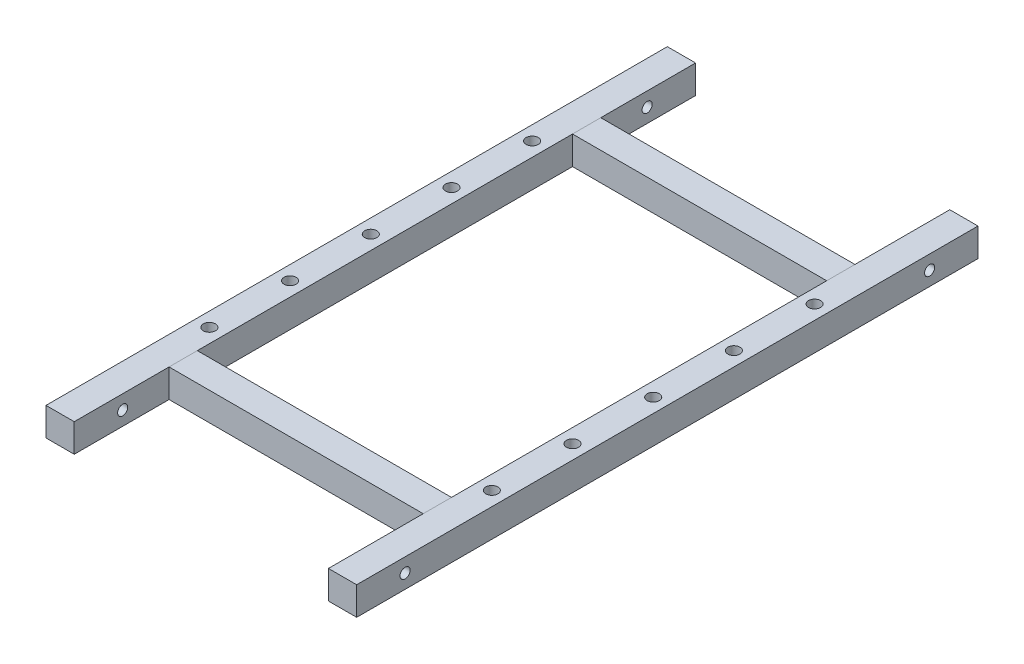
ISO-10303-21;
HEADER;
FILE_DESCRIPTION(('STEP AP214'),'2;1');
FILE_NAME('part.step','',(''),(''),'','','');
FILE_SCHEMA(('AUTOMOTIVE_DESIGN { 1 0 10303 214 1 1 1 1 }'));
ENDSEC;
DATA;
#1=APPLICATION_CONTEXT('core data for automotive mechanical design processes');
#2=APPLICATION_PROTOCOL_DEFINITION('international standard','automotive_design',2000,#1);
#3=PRODUCT_CONTEXT('',#1,'mechanical');
#4=PRODUCT('Part','Part','',(#3));
#5=PRODUCT_RELATED_PRODUCT_CATEGORY('part','',(#4));
#6=PRODUCT_DEFINITION_FORMATION('','',#4);
#7=PRODUCT_DEFINITION_CONTEXT('part definition',#1,'design');
#8=PRODUCT_DEFINITION('design','',#6,#7);
#9=PRODUCT_DEFINITION_SHAPE('','',#8);
#10=(LENGTH_UNIT() NAMED_UNIT(*) SI_UNIT(.MILLI.,.METRE.));
#11=(NAMED_UNIT(*) PLANE_ANGLE_UNIT() SI_UNIT($,.RADIAN.));
#12=(NAMED_UNIT(*) SI_UNIT($,.STERADIAN.) SOLID_ANGLE_UNIT());
#13=UNCERTAINTY_MEASURE_WITH_UNIT(LENGTH_MEASURE(1.E-05),#10,'distance_accuracy_value','');
#14=(GEOMETRIC_REPRESENTATION_CONTEXT(3) GLOBAL_UNCERTAINTY_ASSIGNED_CONTEXT((#13)) GLOBAL_UNIT_ASSIGNED_CONTEXT((#10,
#11,#12)) REPRESENTATION_CONTEXT('',''));
#15=CARTESIAN_POINT('',(0.,0.,0.));
#16=DIRECTION('',(0.,0.,1.));
#17=DIRECTION('',(1.,0.,0.));
#18=AXIS2_PLACEMENT_3D('',#15,#16,#17);
#19=CARTESIAN_POINT('',(35.,3.5,-46.5));
#20=DIRECTION('',(0.,-1.,0.));
#21=DIRECTION('',(0.,0.,-1.));
#22=AXIS2_PLACEMENT_3D('',#19,#20,#21);
#23=PLANE('',#22);
#24=DIRECTION('',(0.,0.,-1.));
#25=VECTOR('',#24,1.);
#26=CARTESIAN_POINT('',(31.5,3.5,77.));
#27=LINE('',#26,#25);
#28=CARTESIAN_POINT('',(31.5,3.5,-46.5));
#29=VERTEX_POINT('',#28);
#30=CARTESIAN_POINT('',(31.5,3.5,-53.5));
#31=VERTEX_POINT('',#30);
#32=EDGE_CURVE('E95',#29,#31,#27,.T.);
#33=ORIENTED_EDGE('',*,*,#32,.T.);
#34=DIRECTION('',(-1.,0.,0.));
#35=VECTOR('',#34,1.);
#36=CARTESIAN_POINT('',(35.,3.5,-53.5));
#37=LINE('',#36,#35);
#38=CARTESIAN_POINT('',(-31.5,3.5,-53.5));
#39=VERTEX_POINT('',#38);
#40=EDGE_CURVE('E102',#31,#39,#37,.T.);
#41=ORIENTED_EDGE('',*,*,#40,.T.);
#42=DIRECTION('',(0.,0.,-1.));
#43=VECTOR('',#42,1.);
#44=CARTESIAN_POINT('',(-31.5,3.5,-46.5));
#45=LINE('',#44,#43);
#46=CARTESIAN_POINT('',(-31.5,3.5,-46.5));
#47=VERTEX_POINT('',#46);
#48=EDGE_CURVE('E113',#47,#39,#45,.T.);
#49=ORIENTED_EDGE('',*,*,#48,.F.);
#50=DIRECTION('',(-1.,0.,0.));
#51=VECTOR('',#50,1.);
#52=CARTESIAN_POINT('',(35.,3.5,-46.5));
#53=LINE('',#52,#51);
#54=EDGE_CURVE('E64',#29,#47,#53,.T.);
#55=ORIENTED_EDGE('',*,*,#54,.F.);
#56=EDGE_LOOP('',(#33,#41,#49,#55));
#57=FACE_BOUND('',#56,.T.);
#58=ADVANCED_FACE('F61',(#57),#23,.F.);
#59=CARTESIAN_POINT('',(35.,3.5,-53.5));
#60=DIRECTION('',(0.,0.,1.));
#61=DIRECTION('',(1.,0.,0.));
#62=AXIS2_PLACEMENT_3D('',#59,#60,#61);
#63=PLANE('',#62);
#64=DIRECTION('',(0.,1.,0.));
#65=VECTOR('',#64,1.);
#66=CARTESIAN_POINT('',(31.5,3.5,-53.5));
#67=LINE('',#66,#65);
#68=CARTESIAN_POINT('',(31.5,-3.5,-53.5));
#69=VERTEX_POINT('',#68);
#70=EDGE_CURVE('E98',#69,#31,#67,.T.);
#71=ORIENTED_EDGE('',*,*,#70,.F.);
#72=DIRECTION('',(-1.,0.,0.));
#73=VECTOR('',#72,1.);
#74=CARTESIAN_POINT('',(35.,-3.5,-53.5));
#75=LINE('',#74,#73);
#76=CARTESIAN_POINT('',(-31.5,-3.5,-53.5));
#77=VERTEX_POINT('',#76);
#78=EDGE_CURVE('E122',#69,#77,#75,.T.);
#79=ORIENTED_EDGE('',*,*,#78,.T.);
#80=DIRECTION('',(0.,-1.,0.));
#81=VECTOR('',#80,1.);
#82=CARTESIAN_POINT('',(-31.5,3.5,-53.5));
#83=LINE('',#82,#81);
#84=EDGE_CURVE('E126',#39,#77,#83,.T.);
#85=ORIENTED_EDGE('',*,*,#84,.F.);
#86=ORIENTED_EDGE('',*,*,#40,.F.);
#87=EDGE_LOOP('',(#71,#79,#85,#86));
#88=FACE_BOUND('',#87,.T.);
#89=ADVANCED_FACE('F134',(#88),#63,.F.);
#90=CARTESIAN_POINT('',(35.,-3.5,-46.5));
#91=DIRECTION('',(0.,1.,0.));
#92=DIRECTION('',(0.,0.,1.));
#93=AXIS2_PLACEMENT_3D('',#90,#91,#92);
#94=PLANE('',#93);
#95=DIRECTION('',(0.,0.,-1.));
#96=VECTOR('',#95,1.);
#97=CARTESIAN_POINT('',(31.5,-3.5,77.));
#98=LINE('',#97,#96);
#99=CARTESIAN_POINT('',(31.5,-3.5,-46.5));
#100=VERTEX_POINT('',#99);
#101=EDGE_CURVE('E13',#100,#69,#98,.T.);
#102=ORIENTED_EDGE('',*,*,#101,.F.);
#103=DIRECTION('',(-1.,0.,0.));
#104=VECTOR('',#103,1.);
#105=CARTESIAN_POINT('',(35.,-3.5,-46.5));
#106=LINE('',#105,#104);
#107=CARTESIAN_POINT('',(-31.5,-3.5,-46.5));
#108=VERTEX_POINT('',#107);
#109=EDGE_CURVE('E109',#100,#108,#106,.T.);
#110=ORIENTED_EDGE('',*,*,#109,.T.);
#111=DIRECTION('',(0.,0.,-1.));
#112=VECTOR('',#111,1.);
#113=CARTESIAN_POINT('',(-31.5,-3.5,77.));
#114=LINE('',#113,#112);
#115=EDGE_CURVE('E115',#108,#77,#114,.T.);
#116=ORIENTED_EDGE('',*,*,#115,.T.);
#117=ORIENTED_EDGE('',*,*,#78,.F.);
#118=EDGE_LOOP('',(#102,#110,#116,#117));
#119=FACE_BOUND('',#118,.T.);
#120=ADVANCED_FACE('F135',(#119),#94,.F.);
#121=CARTESIAN_POINT('',(35.,3.5,-46.5));
#122=DIRECTION('',(0.,0.,-1.));
#123=DIRECTION('',(-1.,0.,0.));
#124=AXIS2_PLACEMENT_3D('',#121,#122,#123);
#125=PLANE('',#124);
#126=DIRECTION('',(0.,-1.,0.));
#127=VECTOR('',#126,1.);
#128=CARTESIAN_POINT('',(31.5,3.5,-46.5));
#129=LINE('',#128,#127);
#130=EDGE_CURVE('E70',#29,#100,#129,.T.);
#131=ORIENTED_EDGE('',*,*,#130,.F.);
#132=ORIENTED_EDGE('',*,*,#54,.T.);
#133=DIRECTION('',(0.,1.,0.));
#134=VECTOR('',#133,1.);
#135=CARTESIAN_POINT('',(-31.5,3.5,-46.5));
#136=LINE('',#135,#134);
#137=EDGE_CURVE('E114',#108,#47,#136,.T.);
#138=ORIENTED_EDGE('',*,*,#137,.F.);
#139=ORIENTED_EDGE('',*,*,#109,.F.);
#140=EDGE_LOOP('',(#131,#132,#138,#139));
#141=FACE_BOUND('',#140,.T.);
#142=ADVANCED_FACE('F106',(#141),#125,.F.);
#143=CARTESIAN_POINT('',(-31.5,3.5,77.));
#144=DIRECTION('',(-1.,0.,0.));
#145=DIRECTION('',(0.,0.,1.));
#146=AXIS2_PLACEMENT_3D('',#143,#144,#145);
#147=PLANE('',#146);
#148=ORIENTED_EDGE('',*,*,#137,.T.);
#149=ORIENTED_EDGE('',*,*,#48,.T.);
#150=ORIENTED_EDGE('',*,*,#84,.T.);
#151=ORIENTED_EDGE('',*,*,#115,.F.);
#152=EDGE_LOOP('',(#148,#149,#150,#151));
#153=FACE_BOUND('',#152,.T.);
#154=ADVANCED_FACE('F132',(#153),#147,.T.);
#155=CARTESIAN_POINT('',(31.5,3.5,77.));
#156=DIRECTION('',(1.,0.,0.));
#157=DIRECTION('',(0.,0.,-1.));
#158=AXIS2_PLACEMENT_3D('',#155,#156,#157);
#159=PLANE('',#158);
#160=ORIENTED_EDGE('',*,*,#70,.T.);
#161=ORIENTED_EDGE('',*,*,#32,.F.);
#162=ORIENTED_EDGE('',*,*,#130,.T.);
#163=ORIENTED_EDGE('',*,*,#101,.T.);
#164=EDGE_LOOP('',(#160,#161,#162,#163));
#165=FACE_BOUND('',#164,.T.);
#166=ADVANCED_FACE('F97',(#165),#159,.T.);
#167=CLOSED_SHELL('',(#58,#89,#120,#142,#154,#166));
#168=MANIFOLD_SOLID_BREP('B2',#167);
#169=CARTESIAN_POINT('',(31.5,3.5,77.));
#170=DIRECTION('',(1.,0.,0.));
#171=DIRECTION('',(0.,0.,-1.));
#172=AXIS2_PLACEMENT_3D('',#169,#170,#171);
#173=PLANE('',#172);
#174=DIRECTION('',(0.,-1.,0.));
#175=VECTOR('',#174,1.);
#176=CARTESIAN_POINT('',(31.5,3.5,53.5));
#177=LINE('',#176,#175);
#178=CARTESIAN_POINT('',(31.5,3.5,53.5));
#179=VERTEX_POINT('',#178);
#180=CARTESIAN_POINT('',(31.5,-3.5,53.5));
#181=VERTEX_POINT('',#180);
#182=EDGE_CURVE('E254',#179,#181,#177,.T.);
#183=ORIENTED_EDGE('',*,*,#182,.T.);
#184=DIRECTION('',(0.,0.,-1.));
#185=VECTOR('',#184,1.);
#186=CARTESIAN_POINT('',(31.5,-3.5,77.));
#187=LINE('',#186,#185);
#188=CARTESIAN_POINT('',(31.5,-3.5,46.5));
#189=VERTEX_POINT('',#188);
#190=EDGE_CURVE('E281',#181,#189,#187,.T.);
#191=ORIENTED_EDGE('',*,*,#190,.T.);
#192=DIRECTION('',(0.,1.,0.));
#193=VECTOR('',#192,1.);
#194=CARTESIAN_POINT('',(31.5,3.5,46.5));
#195=LINE('',#194,#193);
#196=CARTESIAN_POINT('',(31.5,3.5,46.5));
#197=VERTEX_POINT('',#196);
#198=EDGE_CURVE('E292',#189,#197,#195,.T.);
#199=ORIENTED_EDGE('',*,*,#198,.T.);
#200=DIRECTION('',(0.,0.,1.));
#201=VECTOR('',#200,1.);
#202=CARTESIAN_POINT('',(31.5,3.5,53.5));
#203=LINE('',#202,#201);
#204=EDGE_CURVE('E231',#197,#179,#203,.T.);
#205=ORIENTED_EDGE('',*,*,#204,.T.);
#206=EDGE_LOOP('',(#183,#191,#199,#205));
#207=FACE_BOUND('',#206,.T.);
#208=ADVANCED_FACE('F223',(#207),#173,.T.);
#209=CARTESIAN_POINT('',(35.,3.5,53.5));
#210=DIRECTION('',(0.,-1.,0.));
#211=DIRECTION('',(0.,0.,-1.));
#212=AXIS2_PLACEMENT_3D('',#209,#210,#211);
#213=PLANE('',#212);
#214=DIRECTION('',(0.,0.,-1.));
#215=VECTOR('',#214,1.);
#216=CARTESIAN_POINT('',(-31.5,3.5,53.5));
#217=LINE('',#216,#215);
#218=CARTESIAN_POINT('',(-31.5,3.5,53.5));
#219=VERTEX_POINT('',#218);
#220=CARTESIAN_POINT('',(-31.5,3.5,46.5));
#221=VERTEX_POINT('',#220);
#222=EDGE_CURVE('E59',#219,#221,#217,.T.);
#223=ORIENTED_EDGE('',*,*,#222,.F.);
#224=DIRECTION('',(-1.,0.,0.));
#225=VECTOR('',#224,1.);
#226=CARTESIAN_POINT('',(35.,3.5,53.5));
#227=LINE('',#226,#225);
#228=EDGE_CURVE('E286',#179,#219,#227,.T.);
#229=ORIENTED_EDGE('',*,*,#228,.F.);
#230=ORIENTED_EDGE('',*,*,#204,.F.);
#231=DIRECTION('',(-1.,0.,0.));
#232=VECTOR('',#231,1.);
#233=CARTESIAN_POINT('',(35.,3.5,46.5));
#234=LINE('',#233,#232);
#235=EDGE_CURVE('E274',#197,#221,#234,.T.);
#236=ORIENTED_EDGE('',*,*,#235,.T.);
#237=EDGE_LOOP('',(#223,#229,#230,#236));
#238=FACE_BOUND('',#237,.T.);
#239=ADVANCED_FACE('F279',(#238),#213,.F.);
#240=CARTESIAN_POINT('',(35.,3.5,46.5));
#241=DIRECTION('',(0.,0.,1.));
#242=DIRECTION('',(1.,0.,0.));
#243=AXIS2_PLACEMENT_3D('',#240,#241,#242);
#244=PLANE('',#243);
#245=DIRECTION('',(0.,-1.,0.));
#246=VECTOR('',#245,1.);
#247=CARTESIAN_POINT('',(-31.5,3.5,46.5));
#248=LINE('',#247,#246);
#249=CARTESIAN_POINT('',(-31.5,-3.5,46.5));
#250=VERTEX_POINT('',#249);
#251=EDGE_CURVE('E259',#221,#250,#248,.T.);
#252=ORIENTED_EDGE('',*,*,#251,.F.);
#253=ORIENTED_EDGE('',*,*,#235,.F.);
#254=ORIENTED_EDGE('',*,*,#198,.F.);
#255=DIRECTION('',(-1.,0.,0.));
#256=VECTOR('',#255,1.);
#257=CARTESIAN_POINT('',(35.,-3.5,46.5));
#258=LINE('',#257,#256);
#259=EDGE_CURVE('E276',#189,#250,#258,.T.);
#260=ORIENTED_EDGE('',*,*,#259,.T.);
#261=EDGE_LOOP('',(#252,#253,#254,#260));
#262=FACE_BOUND('',#261,.T.);
#263=ADVANCED_FACE('F272',(#262),#244,.F.);
#264=CARTESIAN_POINT('',(35.,-3.5,53.5));
#265=DIRECTION('',(0.,1.,0.));
#266=DIRECTION('',(0.,0.,1.));
#267=AXIS2_PLACEMENT_3D('',#264,#265,#266);
#268=PLANE('',#267);
#269=DIRECTION('',(0.,0.,-1.));
#270=VECTOR('',#269,1.);
#271=CARTESIAN_POINT('',(-31.5,-3.5,77.));
#272=LINE('',#271,#270);
#273=CARTESIAN_POINT('',(-31.5,-3.5,53.5));
#274=VERTEX_POINT('',#273);
#275=EDGE_CURVE('E277',#274,#250,#272,.T.);
#276=ORIENTED_EDGE('',*,*,#275,.T.);
#277=ORIENTED_EDGE('',*,*,#259,.F.);
#278=ORIENTED_EDGE('',*,*,#190,.F.);
#279=DIRECTION('',(-1.,0.,0.));
#280=VECTOR('',#279,1.);
#281=CARTESIAN_POINT('',(35.,-3.5,53.5));
#282=LINE('',#281,#280);
#283=EDGE_CURVE('E283',#181,#274,#282,.T.);
#284=ORIENTED_EDGE('',*,*,#283,.T.);
#285=EDGE_LOOP('',(#276,#277,#278,#284));
#286=FACE_BOUND('',#285,.T.);
#287=ADVANCED_FACE('F297',(#286),#268,.F.);
#288=CARTESIAN_POINT('',(35.,3.5,53.5));
#289=DIRECTION('',(0.,0.,-1.));
#290=DIRECTION('',(-1.,0.,0.));
#291=AXIS2_PLACEMENT_3D('',#288,#289,#290);
#292=PLANE('',#291);
#293=DIRECTION('',(0.,1.,0.));
#294=VECTOR('',#293,1.);
#295=CARTESIAN_POINT('',(-31.5,3.5,53.5));
#296=LINE('',#295,#294);
#297=EDGE_CURVE('E237',#274,#219,#296,.T.);
#298=ORIENTED_EDGE('',*,*,#297,.F.);
#299=ORIENTED_EDGE('',*,*,#283,.F.);
#300=ORIENTED_EDGE('',*,*,#182,.F.);
#301=ORIENTED_EDGE('',*,*,#228,.T.);
#302=EDGE_LOOP('',(#298,#299,#300,#301));
#303=FACE_BOUND('',#302,.T.);
#304=ADVANCED_FACE('F225',(#303),#292,.F.);
#305=CARTESIAN_POINT('',(-31.5,3.5,77.));
#306=DIRECTION('',(-1.,0.,0.));
#307=DIRECTION('',(0.,0.,1.));
#308=AXIS2_PLACEMENT_3D('',#305,#306,#307);
#309=PLANE('',#308);
#310=ORIENTED_EDGE('',*,*,#297,.T.);
#311=ORIENTED_EDGE('',*,*,#222,.T.);
#312=ORIENTED_EDGE('',*,*,#251,.T.);
#313=ORIENTED_EDGE('',*,*,#275,.F.);
#314=EDGE_LOOP('',(#310,#311,#312,#313));
#315=FACE_BOUND('',#314,.T.);
#316=ADVANCED_FACE('F264',(#315),#309,.T.);
#317=CLOSED_SHELL('',(#208,#239,#263,#287,#304,#316));
#318=MANIFOLD_SOLID_BREP('B7',#317);
#319=CARTESIAN_POINT('',(31.5,3.5,77.));
#320=DIRECTION('',(1.,0.,0.));
#321=DIRECTION('',(0.,0.,-1.));
#322=AXIS2_PLACEMENT_3D('',#319,#320,#321);
#323=PLANE('',#322);
#324=CARTESIAN_POINT('',(31.5,0.,65.));
#325=DIRECTION('',(-1.,0.,0.));
#326=DIRECTION('',(0.,0.,1.));
#327=AXIS2_PLACEMENT_3D('',#324,#325,#326);
#328=CIRCLE('',#327,1.25);
#329=CARTESIAN_POINT('',(31.5,0.,66.25));
#330=VERTEX_POINT('',#329);
#331=EDGE_CURVE('E466',#330,#330,#328,.F.);
#332=ORIENTED_EDGE('',*,*,#331,.T.);
#333=EDGE_LOOP('',(#332));
#334=FACE_BOUND('',#333,.T.);
#335=CARTESIAN_POINT('',(31.5,0.,-65.));
#336=DIRECTION('',(1.,0.,0.));
#337=DIRECTION('',(0.,0.,-1.));
#338=AXIS2_PLACEMENT_3D('',#335,#336,#337);
#339=CIRCLE('',#338,1.25);
#340=CARTESIAN_POINT('',(31.5,0.,-66.25));
#341=VERTEX_POINT('',#340);
#342=EDGE_CURVE('E450',#341,#341,#339,.F.);
#343=ORIENTED_EDGE('',*,*,#342,.F.);
#344=EDGE_LOOP('',(#343));
#345=FACE_BOUND('',#344,.T.);
#346=DIRECTION('',(0.,-1.,0.));
#347=VECTOR('',#346,1.);
#348=CARTESIAN_POINT('',(31.5,3.5,-77.));
#349=LINE('',#348,#347);
#350=CARTESIAN_POINT('',(31.5,3.5,-77.));
#351=VERTEX_POINT('',#350);
#352=CARTESIAN_POINT('',(31.5,-3.5,-77.));
#353=VERTEX_POINT('',#352);
#354=EDGE_CURVE('E447',#351,#353,#349,.T.);
#355=ORIENTED_EDGE('',*,*,#354,.T.);
#356=DIRECTION('',(0.,0.,-1.));
#357=VECTOR('',#356,1.);
#358=CARTESIAN_POINT('',(31.5,-3.5,77.));
#359=LINE('',#358,#357);
#360=CARTESIAN_POINT('',(31.5,-3.5,77.));
#361=VERTEX_POINT('',#360);
#362=EDGE_CURVE('E221',#361,#353,#359,.T.);
#363=ORIENTED_EDGE('',*,*,#362,.F.);
#364=DIRECTION('',(0.,-1.,0.));
#365=VECTOR('',#364,1.);
#366=CARTESIAN_POINT('',(31.5,3.5,77.));
#367=LINE('',#366,#365);
#368=CARTESIAN_POINT('',(31.5,3.5,77.));
#369=VERTEX_POINT('',#368);
#370=EDGE_CURVE('E435',#369,#361,#367,.T.);
#371=ORIENTED_EDGE('',*,*,#370,.F.);
#372=DIRECTION('',(0.,0.,-1.));
#373=VECTOR('',#372,1.);
#374=CARTESIAN_POINT('',(31.5,3.5,77.));
#375=LINE('',#374,#373);
#376=EDGE_CURVE('E443',#369,#351,#375,.T.);
#377=ORIENTED_EDGE('',*,*,#376,.T.);
#378=EDGE_LOOP('',(#355,#363,#371,#377));
#379=FACE_BOUND('',#378,.T.);
#380=ADVANCED_FACE('F384',(#334,#345,#379),#323,.F.);
#381=CARTESIAN_POINT('',(31.5,-3.5,77.));
#382=DIRECTION('',(0.,1.,0.));
#383=DIRECTION('',(0.,0.,1.));
#384=AXIS2_PLACEMENT_3D('',#381,#382,#383);
#385=PLANE('',#384);
#386=CARTESIAN_POINT('',(34.9999999999885,-3.5,20.));
#387=DIRECTION('',(0.,1.,0.));
#388=DIRECTION('',(0.,0.,1.));
#389=AXIS2_PLACEMENT_3D('',#386,#387,#388);
#390=CIRCLE('',#389,1.5);
#391=CARTESIAN_POINT('',(34.9999999999885,-3.5,21.5));
#392=VERTEX_POINT('',#391);
#393=EDGE_CURVE('E496',#392,#392,#390,.T.);
#394=ORIENTED_EDGE('',*,*,#393,.T.);
#395=EDGE_LOOP('',(#394));
#396=FACE_BOUND('',#395,.T.);
#397=CARTESIAN_POINT('',(34.9999999999886,-3.5,40.));
#398=DIRECTION('',(0.,1.,0.));
#399=DIRECTION('',(0.,0.,1.));
#400=AXIS2_PLACEMENT_3D('',#397,#398,#399);
#401=CIRCLE('',#400,1.5);
#402=CARTESIAN_POINT('',(34.9999999999886,-3.5,41.5));
#403=VERTEX_POINT('',#402);
#404=EDGE_CURVE('E490',#403,#403,#401,.T.);
#405=ORIENTED_EDGE('',*,*,#404,.T.);
#406=EDGE_LOOP('',(#405));
#407=FACE_BOUND('',#406,.T.);
#408=CARTESIAN_POINT('',(34.9999999999886,-3.5,-40.));
#409=DIRECTION('',(0.,1.,0.));
#410=DIRECTION('',(0.,0.,1.));
#411=AXIS2_PLACEMENT_3D('',#408,#409,#410);
#412=CIRCLE('',#411,1.5);
#413=CARTESIAN_POINT('',(34.9999999999886,-3.5,-38.5));
#414=VERTEX_POINT('',#413);
#415=EDGE_CURVE('E484',#414,#414,#412,.T.);
#416=ORIENTED_EDGE('',*,*,#415,.T.);
#417=EDGE_LOOP('',(#416));
#418=FACE_BOUND('',#417,.T.);
#419=CARTESIAN_POINT('',(34.9999999999885,-3.5,-20.));
#420=DIRECTION('',(0.,1.,0.));
#421=DIRECTION('',(0.,0.,1.));
#422=AXIS2_PLACEMENT_3D('',#419,#420,#421);
#423=CIRCLE('',#422,1.5);
#424=CARTESIAN_POINT('',(34.9999999999885,-3.5,-18.5));
#425=VERTEX_POINT('',#424);
#426=EDGE_CURVE('E478',#425,#425,#423,.T.);
#427=ORIENTED_EDGE('',*,*,#426,.T.);
#428=EDGE_LOOP('',(#427));
#429=FACE_BOUND('',#428,.T.);
#430=CARTESIAN_POINT('',(34.9999999999885,-3.5,0.));
#431=DIRECTION('',(0.,1.,0.));
#432=DIRECTION('',(0.,0.,1.));
#433=AXIS2_PLACEMENT_3D('',#430,#431,#432);
#434=CIRCLE('',#433,1.5);
#435=CARTESIAN_POINT('',(34.9999999999885,-3.5,1.50000000000002));
#436=VERTEX_POINT('',#435);
#437=EDGE_CURVE('E472',#436,#436,#434,.T.);
#438=ORIENTED_EDGE('',*,*,#437,.T.);
#439=EDGE_LOOP('',(#438));
#440=FACE_BOUND('',#439,.T.);
#441=DIRECTION('',(1.,0.,0.));
#442=VECTOR('',#441,1.);
#443=CARTESIAN_POINT('',(31.5,-3.5,-77.));
#444=LINE('',#443,#442);
#445=CARTESIAN_POINT('',(38.5,-3.5,-77.));
#446=VERTEX_POINT('',#445);
#447=EDGE_CURVE('E439',#353,#446,#444,.T.);
#448=ORIENTED_EDGE('',*,*,#447,.T.);
#449=DIRECTION('',(0.,0.,-1.));
#450=VECTOR('',#449,1.);
#451=CARTESIAN_POINT('',(38.5,-3.5,77.));
#452=LINE('',#451,#450);
#453=CARTESIAN_POINT('',(38.5,-3.5,77.));
#454=VERTEX_POINT('',#453);
#455=EDGE_CURVE('E392',#454,#446,#452,.T.);
#456=ORIENTED_EDGE('',*,*,#455,.F.);
#457=DIRECTION('',(1.,0.,0.));
#458=VECTOR('',#457,1.);
#459=CARTESIAN_POINT('',(31.5,-3.5,77.));
#460=LINE('',#459,#458);
#461=EDGE_CURVE('E430',#361,#454,#460,.T.);
#462=ORIENTED_EDGE('',*,*,#461,.F.);
#463=ORIENTED_EDGE('',*,*,#362,.T.);
#464=EDGE_LOOP('',(#448,#456,#462,#463));
#465=FACE_BOUND('',#464,.T.);
#466=ADVANCED_FACE('F438',(#396,#407,#418,#429,#440,#465),#385,.F.);
#467=CARTESIAN_POINT('',(38.5,3.5,77.));
#468=DIRECTION('',(-1.,0.,0.));
#469=DIRECTION('',(0.,0.,1.));
#470=AXIS2_PLACEMENT_3D('',#467,#468,#469);
#471=PLANE('',#470);
#472=CARTESIAN_POINT('',(38.5,0.,65.));
#473=DIRECTION('',(-1.,0.,0.));
#474=DIRECTION('',(0.,0.,1.));
#475=AXIS2_PLACEMENT_3D('',#472,#473,#474);
#476=CIRCLE('',#475,1.25);
#477=CARTESIAN_POINT('',(38.5,0.,66.25));
#478=VERTEX_POINT('',#477);
#479=EDGE_CURVE('E469',#478,#478,#476,.T.);
#480=ORIENTED_EDGE('',*,*,#479,.T.);
#481=EDGE_LOOP('',(#480));
#482=FACE_BOUND('',#481,.T.);
#483=CARTESIAN_POINT('',(38.5,0.,-65.));
#484=DIRECTION('',(1.,0.,0.));
#485=DIRECTION('',(0.,0.,-1.));
#486=AXIS2_PLACEMENT_3D('',#483,#484,#485);
#487=CIRCLE('',#486,1.25);
#488=CARTESIAN_POINT('',(38.5,0.,-66.25));
#489=VERTEX_POINT('',#488);
#490=EDGE_CURVE('E463',#489,#489,#487,.T.);
#491=ORIENTED_EDGE('',*,*,#490,.F.);
#492=EDGE_LOOP('',(#491));
#493=FACE_BOUND('',#492,.T.);
#494=DIRECTION('',(0.,1.,0.));
#495=VECTOR('',#494,1.);
#496=CARTESIAN_POINT('',(38.5,3.5,-77.));
#497=LINE('',#496,#495);
#498=CARTESIAN_POINT('',(38.5,3.5,-77.));
#499=VERTEX_POINT('',#498);
#500=EDGE_CURVE('E417',#446,#499,#497,.T.);
#501=ORIENTED_EDGE('',*,*,#500,.T.);
#502=DIRECTION('',(0.,0.,-1.));
#503=VECTOR('',#502,1.);
#504=CARTESIAN_POINT('',(38.5,3.5,77.));
#505=LINE('',#504,#503);
#506=CARTESIAN_POINT('',(38.5,3.5,77.));
#507=VERTEX_POINT('',#506);
#508=EDGE_CURVE('E440',#507,#499,#505,.T.);
#509=ORIENTED_EDGE('',*,*,#508,.F.);
#510=DIRECTION('',(0.,1.,0.));
#511=VECTOR('',#510,1.);
#512=CARTESIAN_POINT('',(38.5,3.5,77.));
#513=LINE('',#512,#511);
#514=EDGE_CURVE('E433',#454,#507,#513,.T.);
#515=ORIENTED_EDGE('',*,*,#514,.F.);
#516=ORIENTED_EDGE('',*,*,#455,.T.);
#517=EDGE_LOOP('',(#501,#509,#515,#516));
#518=FACE_BOUND('',#517,.T.);
#519=ADVANCED_FACE('F441',(#482,#493,#518),#471,.F.);
#520=CARTESIAN_POINT('',(31.5,3.5,77.));
#521=DIRECTION('',(0.,-1.,0.));
#522=DIRECTION('',(0.,0.,-1.));
#523=AXIS2_PLACEMENT_3D('',#520,#521,#522);
#524=PLANE('',#523);
#525=CARTESIAN_POINT('',(34.9999999999885,3.5,20.));
#526=DIRECTION('',(0.,1.,0.));
#527=DIRECTION('',(0.,0.,1.));
#528=AXIS2_PLACEMENT_3D('',#525,#526,#527);
#529=CIRCLE('',#528,1.49999999999999);
#530=CARTESIAN_POINT('',(34.9999999999885,3.5,21.5));
#531=VERTEX_POINT('',#530);
#532=EDGE_CURVE('E499',#531,#531,#529,.T.);
#533=ORIENTED_EDGE('',*,*,#532,.F.);
#534=EDGE_LOOP('',(#533));
#535=FACE_BOUND('',#534,.T.);
#536=CARTESIAN_POINT('',(34.9999999999886,3.5,40.));
#537=DIRECTION('',(0.,1.,0.));
#538=DIRECTION('',(0.,0.,1.));
#539=AXIS2_PLACEMENT_3D('',#536,#537,#538);
#540=CIRCLE('',#539,1.49999999999999);
#541=CARTESIAN_POINT('',(34.9999999999886,3.5,41.5));
#542=VERTEX_POINT('',#541);
#543=EDGE_CURVE('E493',#542,#542,#540,.T.);
#544=ORIENTED_EDGE('',*,*,#543,.F.);
#545=EDGE_LOOP('',(#544));
#546=FACE_BOUND('',#545,.T.);
#547=CARTESIAN_POINT('',(34.9999999999886,3.5,-40.));
#548=DIRECTION('',(0.,1.,0.));
#549=DIRECTION('',(0.,0.,1.));
#550=AXIS2_PLACEMENT_3D('',#547,#548,#549);
#551=CIRCLE('',#550,1.49999999999999);
#552=CARTESIAN_POINT('',(34.9999999999886,3.5,-38.5));
#553=VERTEX_POINT('',#552);
#554=EDGE_CURVE('E487',#553,#553,#551,.T.);
#555=ORIENTED_EDGE('',*,*,#554,.F.);
#556=EDGE_LOOP('',(#555));
#557=FACE_BOUND('',#556,.T.);
#558=CARTESIAN_POINT('',(34.9999999999885,3.5,-20.));
#559=DIRECTION('',(0.,1.,0.));
#560=DIRECTION('',(0.,0.,1.));
#561=AXIS2_PLACEMENT_3D('',#558,#559,#560);
#562=CIRCLE('',#561,1.49999999999999);
#563=CARTESIAN_POINT('',(34.9999999999885,3.5,-18.5));
#564=VERTEX_POINT('',#563);
#565=EDGE_CURVE('E481',#564,#564,#562,.T.);
#566=ORIENTED_EDGE('',*,*,#565,.F.);
#567=EDGE_LOOP('',(#566));
#568=FACE_BOUND('',#567,.T.);
#569=CARTESIAN_POINT('',(34.9999999999885,3.5,0.));
#570=DIRECTION('',(0.,1.,0.));
#571=DIRECTION('',(0.,0.,1.));
#572=AXIS2_PLACEMENT_3D('',#569,#570,#571);
#573=CIRCLE('',#572,1.49999999999999);
#574=CARTESIAN_POINT('',(34.9999999999885,3.5,1.5));
#575=VERTEX_POINT('',#574);
#576=EDGE_CURVE('E475',#575,#575,#573,.T.);
#577=ORIENTED_EDGE('',*,*,#576,.F.);
#578=EDGE_LOOP('',(#577));
#579=FACE_BOUND('',#578,.T.);
#580=DIRECTION('',(-1.,0.,0.));
#581=VECTOR('',#580,1.);
#582=CARTESIAN_POINT('',(31.5,3.5,-77.));
#583=LINE('',#582,#581);
#584=EDGE_CURVE('E423',#499,#351,#583,.T.);
#585=ORIENTED_EDGE('',*,*,#584,.T.);
#586=ORIENTED_EDGE('',*,*,#376,.F.);
#587=DIRECTION('',(-1.,0.,0.));
#588=VECTOR('',#587,1.);
#589=CARTESIAN_POINT('',(31.5,3.5,77.));
#590=LINE('',#589,#588);
#591=EDGE_CURVE('E400',#507,#369,#590,.T.);
#592=ORIENTED_EDGE('',*,*,#591,.F.);
#593=ORIENTED_EDGE('',*,*,#508,.T.);
#594=EDGE_LOOP('',(#585,#586,#592,#593));
#595=FACE_BOUND('',#594,.T.);
#596=ADVANCED_FACE('F455',(#535,#546,#557,#568,#579,#595),#524,.F.);
#597=CARTESIAN_POINT('',(70.,0.,77.));
#598=DIRECTION('',(0.,0.,1.));
#599=DIRECTION('',(1.,0.,0.));
#600=AXIS2_PLACEMENT_3D('',#597,#598,#599);
#601=PLANE('',#600);
#602=ORIENTED_EDGE('',*,*,#370,.T.);
#603=ORIENTED_EDGE('',*,*,#461,.T.);
#604=ORIENTED_EDGE('',*,*,#514,.T.);
#605=ORIENTED_EDGE('',*,*,#591,.T.);
#606=EDGE_LOOP('',(#602,#603,#604,#605));
#607=FACE_BOUND('',#606,.T.);
#608=ADVANCED_FACE('F431',(#607),#601,.T.);
#609=CARTESIAN_POINT('',(70.,0.,-77.));
#610=DIRECTION('',(0.,0.,1.));
#611=DIRECTION('',(1.,0.,0.));
#612=AXIS2_PLACEMENT_3D('',#609,#610,#611);
#613=PLANE('',#612);
#614=ORIENTED_EDGE('',*,*,#354,.F.);
#615=ORIENTED_EDGE('',*,*,#584,.F.);
#616=ORIENTED_EDGE('',*,*,#500,.F.);
#617=ORIENTED_EDGE('',*,*,#447,.F.);
#618=EDGE_LOOP('',(#614,#615,#616,#617));
#619=FACE_BOUND('',#618,.T.);
#620=ADVANCED_FACE('F458',(#619),#613,.F.);
#621=CARTESIAN_POINT('',(38.5,0.,-65.));
#622=DIRECTION('',(-1.,0.,0.));
#623=DIRECTION('',(0.,0.,1.));
#624=AXIS2_PLACEMENT_3D('',#621,#622,#623);
#625=CYLINDRICAL_SURFACE('',#624,1.25);
#626=ORIENTED_EDGE('',*,*,#490,.T.);
#627=EDGE_LOOP('',(#626));
#628=FACE_BOUND('',#627,.T.);
#629=ORIENTED_EDGE('',*,*,#342,.T.);
#630=EDGE_LOOP('',(#629));
#631=FACE_BOUND('',#630,.T.);
#632=ADVANCED_FACE('F529',(#628,#631),#625,.F.);
#633=CARTESIAN_POINT('',(38.5,0.,65.));
#634=DIRECTION('',(-1.,0.,0.));
#635=DIRECTION('',(0.,0.,-1.));
#636=AXIS2_PLACEMENT_3D('',#633,#634,#635);
#637=CYLINDRICAL_SURFACE('',#636,1.25);
#638=ORIENTED_EDGE('',*,*,#479,.F.);
#639=EDGE_LOOP('',(#638));
#640=FACE_BOUND('',#639,.T.);
#641=ORIENTED_EDGE('',*,*,#331,.F.);
#642=EDGE_LOOP('',(#641));
#643=FACE_BOUND('',#642,.T.);
#644=ADVANCED_FACE('F519',(#640,#643),#637,.F.);
#645=CARTESIAN_POINT('',(34.9999999999885,3.5,0.));
#646=DIRECTION('',(0.,1.,0.));
#647=DIRECTION('',(0.,0.,1.));
#648=AXIS2_PLACEMENT_3D('',#645,#646,#647);
#649=CYLINDRICAL_SURFACE('',#648,1.49999999999999);
#650=ORIENTED_EDGE('',*,*,#437,.F.);
#651=EDGE_LOOP('',(#650));
#652=FACE_BOUND('',#651,.T.);
#653=ORIENTED_EDGE('',*,*,#576,.T.);
#654=EDGE_LOOP('',(#653));
#655=FACE_BOUND('',#654,.T.);
#656=ADVANCED_FACE('F516',(#652,#655),#649,.F.);
#657=CARTESIAN_POINT('',(34.9999999999885,3.5,-20.));
#658=DIRECTION('',(0.,1.,0.));
#659=DIRECTION('',(0.,0.,1.));
#660=AXIS2_PLACEMENT_3D('',#657,#658,#659);
#661=CYLINDRICAL_SURFACE('',#660,1.49999999999999);
#662=ORIENTED_EDGE('',*,*,#426,.F.);
#663=EDGE_LOOP('',(#662));
#664=FACE_BOUND('',#663,.T.);
#665=ORIENTED_EDGE('',*,*,#565,.T.);
#666=EDGE_LOOP('',(#665));
#667=FACE_BOUND('',#666,.T.);
#668=ADVANCED_FACE('F518',(#664,#667),#661,.F.);
#669=CARTESIAN_POINT('',(34.9999999999886,3.5,-40.));
#670=DIRECTION('',(0.,1.,0.));
#671=DIRECTION('',(0.,0.,1.));
#672=AXIS2_PLACEMENT_3D('',#669,#670,#671);
#673=CYLINDRICAL_SURFACE('',#672,1.49999999999999);
#674=ORIENTED_EDGE('',*,*,#415,.F.);
#675=EDGE_LOOP('',(#674));
#676=FACE_BOUND('',#675,.T.);
#677=ORIENTED_EDGE('',*,*,#554,.T.);
#678=EDGE_LOOP('',(#677));
#679=FACE_BOUND('',#678,.T.);
#680=ADVANCED_FACE('F526',(#676,#679),#673,.F.);
#681=CARTESIAN_POINT('',(34.9999999999886,3.5,40.));
#682=DIRECTION('',(0.,1.,0.));
#683=DIRECTION('',(0.,0.,1.));
#684=AXIS2_PLACEMENT_3D('',#681,#682,#683);
#685=CYLINDRICAL_SURFACE('',#684,1.49999999999999);
#686=ORIENTED_EDGE('',*,*,#404,.F.);
#687=EDGE_LOOP('',(#686));
#688=FACE_BOUND('',#687,.T.);
#689=ORIENTED_EDGE('',*,*,#543,.T.);
#690=EDGE_LOOP('',(#689));
#691=FACE_BOUND('',#690,.T.);
#692=ADVANCED_FACE('F610',(#688,#691),#685,.F.);
#693=CARTESIAN_POINT('',(34.9999999999885,3.5,20.));
#694=DIRECTION('',(0.,1.,0.));
#695=DIRECTION('',(0.,0.,1.));
#696=AXIS2_PLACEMENT_3D('',#693,#694,#695);
#697=CYLINDRICAL_SURFACE('',#696,1.49999999999999);
#698=ORIENTED_EDGE('',*,*,#393,.F.);
#699=EDGE_LOOP('',(#698));
#700=FACE_BOUND('',#699,.T.);
#701=ORIENTED_EDGE('',*,*,#532,.T.);
#702=EDGE_LOOP('',(#701));
#703=FACE_BOUND('',#702,.T.);
#704=ADVANCED_FACE('F503',(#700,#703),#697,.F.);
#705=CLOSED_SHELL('',(#380,#466,#519,#596,#608,#620,#632,#644,#656,#668,#680,#692,#704));
#706=MANIFOLD_SOLID_BREP('B53',#705);
#707=CARTESIAN_POINT('',(-38.5,3.5,77.));
#708=DIRECTION('',(1.,0.,0.));
#709=DIRECTION('',(0.,0.,-1.));
#710=AXIS2_PLACEMENT_3D('',#707,#708,#709);
#711=PLANE('',#710);
#712=CARTESIAN_POINT('',(-38.5,0.,65.));
#713=DIRECTION('',(-1.,0.,0.));
#714=DIRECTION('',(0.,0.,1.));
#715=AXIS2_PLACEMENT_3D('',#712,#713,#714);
#716=CIRCLE('',#715,1.25);
#717=CARTESIAN_POINT('',(-38.5,0.,66.25));
#718=VERTEX_POINT('',#717);
#719=EDGE_CURVE('E750',#718,#718,#716,.T.);
#720=ORIENTED_EDGE('',*,*,#719,.F.);
#721=EDGE_LOOP('',(#720));
#722=FACE_BOUND('',#721,.T.);
#723=CARTESIAN_POINT('',(-38.5,0.,-65.));
#724=DIRECTION('',(1.,0.,0.));
#725=DIRECTION('',(0.,0.,-1.));
#726=AXIS2_PLACEMENT_3D('',#723,#724,#725);
#727=CIRCLE('',#726,1.25);
#728=CARTESIAN_POINT('',(-38.5,0.,-66.25));
#729=VERTEX_POINT('',#728);
#730=EDGE_CURVE('E744',#729,#729,#727,.T.);
#731=ORIENTED_EDGE('',*,*,#730,.T.);
#732=EDGE_LOOP('',(#731));
#733=FACE_BOUND('',#732,.T.);
#734=DIRECTION('',(0.,-1.,0.));
#735=VECTOR('',#734,1.);
#736=CARTESIAN_POINT('',(-38.5,3.5,-77.));
#737=LINE('',#736,#735);
#738=CARTESIAN_POINT('',(-38.5,3.5,-77.));
#739=VERTEX_POINT('',#738);
#740=CARTESIAN_POINT('',(-38.5,-3.5,-77.));
#741=VERTEX_POINT('',#740);
#742=EDGE_CURVE('E731',#739,#741,#737,.T.);
#743=ORIENTED_EDGE('',*,*,#742,.T.);
#744=DIRECTION('',(0.,0.,-1.));
#745=VECTOR('',#744,1.);
#746=CARTESIAN_POINT('',(-38.5,-3.5,77.));
#747=LINE('',#746,#745);
#748=CARTESIAN_POINT('',(-38.5,-3.5,77.));
#749=VERTEX_POINT('',#748);
#750=EDGE_CURVE('E382',#749,#741,#747,.T.);
#751=ORIENTED_EDGE('',*,*,#750,.F.);
#752=DIRECTION('',(0.,-1.,0.));
#753=VECTOR('',#752,1.);
#754=CARTESIAN_POINT('',(-38.5,3.5,77.));
#755=LINE('',#754,#753);
#756=CARTESIAN_POINT('',(-38.5,3.5,77.));
#757=VERTEX_POINT('',#756);
#758=EDGE_CURVE('E718',#757,#749,#755,.T.);
#759=ORIENTED_EDGE('',*,*,#758,.F.);
#760=DIRECTION('',(0.,0.,-1.));
#761=VECTOR('',#760,1.);
#762=CARTESIAN_POINT('',(-38.5,3.5,77.));
#763=LINE('',#762,#761);
#764=EDGE_CURVE('E727',#757,#739,#763,.T.);
#765=ORIENTED_EDGE('',*,*,#764,.T.);
#766=EDGE_LOOP('',(#743,#751,#759,#765));
#767=FACE_BOUND('',#766,.T.);
#768=ADVANCED_FACE('F666',(#722,#733,#767),#711,.F.);
#769=CARTESIAN_POINT('',(-38.5,-3.5,77.));
#770=DIRECTION('',(0.,1.,0.));
#771=DIRECTION('',(0.,0.,1.));
#772=AXIS2_PLACEMENT_3D('',#769,#770,#771);
#773=PLANE('',#772);
#774=CARTESIAN_POINT('',(-34.9999999999885,-3.5,0.));
#775=DIRECTION('',(0.,1.,0.));
#776=DIRECTION('',(0.,0.,1.));
#777=AXIS2_PLACEMENT_3D('',#774,#775,#776);
#778=CIRCLE('',#777,1.5);
#779=CARTESIAN_POINT('',(-34.9999999999885,-3.5,1.50000000000002));
#780=VERTEX_POINT('',#779);
#781=EDGE_CURVE('E777',#780,#780,#778,.T.);
#782=ORIENTED_EDGE('',*,*,#781,.T.);
#783=EDGE_LOOP('',(#782));
#784=FACE_BOUND('',#783,.T.);
#785=CARTESIAN_POINT('',(-34.9999999999885,-3.5,-20.));
#786=DIRECTION('',(0.,1.,0.));
#787=DIRECTION('',(0.,0.,1.));
#788=AXIS2_PLACEMENT_3D('',#785,#786,#787);
#789=CIRCLE('',#788,1.5);
#790=CARTESIAN_POINT('',(-34.9999999999885,-3.5,-18.5));
#791=VERTEX_POINT('',#790);
#792=EDGE_CURVE('E771',#791,#791,#789,.T.);
#793=ORIENTED_EDGE('',*,*,#792,.T.);
#794=EDGE_LOOP('',(#793));
#795=FACE_BOUND('',#794,.T.);
#796=CARTESIAN_POINT('',(-34.9999999999886,-3.5,-40.));
#797=DIRECTION('',(0.,1.,0.));
#798=DIRECTION('',(0.,0.,1.));
#799=AXIS2_PLACEMENT_3D('',#796,#797,#798);
#800=CIRCLE('',#799,1.5);
#801=CARTESIAN_POINT('',(-34.9999999999886,-3.5,-38.5));
#802=VERTEX_POINT('',#801);
#803=EDGE_CURVE('E765',#802,#802,#800,.T.);
#804=ORIENTED_EDGE('',*,*,#803,.T.);
#805=EDGE_LOOP('',(#804));
#806=FACE_BOUND('',#805,.T.);
#807=CARTESIAN_POINT('',(-34.9999999999886,-3.5,40.));
#808=DIRECTION('',(0.,1.,0.));
#809=DIRECTION('',(0.,0.,1.));
#810=AXIS2_PLACEMENT_3D('',#807,#808,#809);
#811=CIRCLE('',#810,1.5);
#812=CARTESIAN_POINT('',(-34.9999999999886,-3.5,41.5));
#813=VERTEX_POINT('',#812);
#814=EDGE_CURVE('E759',#813,#813,#811,.T.);
#815=ORIENTED_EDGE('',*,*,#814,.T.);
#816=EDGE_LOOP('',(#815));
#817=FACE_BOUND('',#816,.T.);
#818=CARTESIAN_POINT('',(-34.9999999999885,-3.5,20.));
#819=DIRECTION('',(0.,1.,0.));
#820=DIRECTION('',(0.,0.,1.));
#821=AXIS2_PLACEMENT_3D('',#818,#819,#820);
#822=CIRCLE('',#821,1.5);
#823=CARTESIAN_POINT('',(-34.9999999999885,-3.5,21.5));
#824=VERTEX_POINT('',#823);
#825=EDGE_CURVE('E753',#824,#824,#822,.T.);
#826=ORIENTED_EDGE('',*,*,#825,.T.);
#827=EDGE_LOOP('',(#826));
#828=FACE_BOUND('',#827,.T.);
#829=DIRECTION('',(1.,0.,0.));
#830=VECTOR('',#829,1.);
#831=CARTESIAN_POINT('',(-38.5,-3.5,-77.));
#832=LINE('',#831,#830);
#833=CARTESIAN_POINT('',(-31.5,-3.5,-77.));
#834=VERTEX_POINT('',#833);
#835=EDGE_CURVE('E722',#741,#834,#832,.T.);
#836=ORIENTED_EDGE('',*,*,#835,.T.);
#837=DIRECTION('',(0.,0.,-1.));
#838=VECTOR('',#837,1.);
#839=CARTESIAN_POINT('',(-31.5,-3.5,77.));
#840=LINE('',#839,#838);
#841=CARTESIAN_POINT('',(-31.5,-3.5,77.));
#842=VERTEX_POINT('',#841);
#843=EDGE_CURVE('E675',#842,#834,#840,.T.);
#844=ORIENTED_EDGE('',*,*,#843,.F.);
#845=DIRECTION('',(1.,0.,0.));
#846=VECTOR('',#845,1.);
#847=CARTESIAN_POINT('',(-38.5,-3.5,77.));
#848=LINE('',#847,#846);
#849=EDGE_CURVE('E713',#749,#842,#848,.T.);
#850=ORIENTED_EDGE('',*,*,#849,.F.);
#851=ORIENTED_EDGE('',*,*,#750,.T.);
#852=EDGE_LOOP('',(#836,#844,#850,#851));
#853=FACE_BOUND('',#852,.T.);
#854=ADVANCED_FACE('F721',(#784,#795,#806,#817,#828,#853),#773,.F.);
#855=CARTESIAN_POINT('',(-31.5,3.5,77.));
#856=DIRECTION('',(-1.,0.,0.));
#857=DIRECTION('',(0.,0.,1.));
#858=AXIS2_PLACEMENT_3D('',#855,#856,#857);
#859=PLANE('',#858);
#860=CARTESIAN_POINT('',(-31.5,0.,65.));
#861=DIRECTION('',(1.,0.,0.));
#862=DIRECTION('',(0.,0.,-1.));
#863=AXIS2_PLACEMENT_3D('',#860,#861,#862);
#864=CIRCLE('',#863,1.25);
#865=CARTESIAN_POINT('',(-31.5,0.,63.75));
#866=VERTEX_POINT('',#865);
#867=EDGE_CURVE('E747',#866,#866,#864,.F.);
#868=ORIENTED_EDGE('',*,*,#867,.T.);
#869=EDGE_LOOP('',(#868));
#870=FACE_BOUND('',#869,.T.);
#871=CARTESIAN_POINT('',(-31.5,0.,-65.));
#872=DIRECTION('',(-1.,0.,0.));
#873=DIRECTION('',(0.,0.,1.));
#874=AXIS2_PLACEMENT_3D('',#871,#872,#873);
#875=CIRCLE('',#874,1.25);
#876=CARTESIAN_POINT('',(-31.5,0.,-63.75));
#877=VERTEX_POINT('',#876);
#878=EDGE_CURVE('E669',#877,#877,#875,.F.);
#879=ORIENTED_EDGE('',*,*,#878,.F.);
#880=EDGE_LOOP('',(#879));
#881=FACE_BOUND('',#880,.T.);
#882=DIRECTION('',(0.,1.,0.));
#883=VECTOR('',#882,1.);
#884=CARTESIAN_POINT('',(-31.5,3.5,-77.));
#885=LINE('',#884,#883);
#886=CARTESIAN_POINT('',(-31.5,3.5,-77.));
#887=VERTEX_POINT('',#886);
#888=EDGE_CURVE('E700',#834,#887,#885,.T.);
#889=ORIENTED_EDGE('',*,*,#888,.T.);
#890=DIRECTION('',(0.,0.,-1.));
#891=VECTOR('',#890,1.);
#892=CARTESIAN_POINT('',(-31.5,3.5,77.));
#893=LINE('',#892,#891);
#894=CARTESIAN_POINT('',(-31.5,3.5,77.));
#895=VERTEX_POINT('',#894);
#896=EDGE_CURVE('E723',#895,#887,#893,.T.);
#897=ORIENTED_EDGE('',*,*,#896,.F.);
#898=DIRECTION('',(0.,1.,0.));
#899=VECTOR('',#898,1.);
#900=CARTESIAN_POINT('',(-31.5,3.5,77.));
#901=LINE('',#900,#899);
#902=EDGE_CURVE('E716',#842,#895,#901,.T.);
#903=ORIENTED_EDGE('',*,*,#902,.F.);
#904=ORIENTED_EDGE('',*,*,#843,.T.);
#905=EDGE_LOOP('',(#889,#897,#903,#904));
#906=FACE_BOUND('',#905,.T.);
#907=ADVANCED_FACE('F725',(#870,#881,#906),#859,.F.);
#908=CARTESIAN_POINT('',(-38.5,3.5,77.));
#909=DIRECTION('',(0.,-1.,0.));
#910=DIRECTION('',(0.,0.,-1.));
#911=AXIS2_PLACEMENT_3D('',#908,#909,#910);
#912=PLANE('',#911);
#913=CARTESIAN_POINT('',(-34.9999999999885,3.5,0.));
#914=DIRECTION('',(0.,1.,0.));
#915=DIRECTION('',(0.,0.,1.));
#916=AXIS2_PLACEMENT_3D('',#913,#914,#915);
#917=CIRCLE('',#916,1.49999999999999);
#918=CARTESIAN_POINT('',(-34.9999999999885,3.5,1.5));
#919=VERTEX_POINT('',#918);
#920=EDGE_CURVE('E780',#919,#919,#917,.T.);
#921=ORIENTED_EDGE('',*,*,#920,.F.);
#922=EDGE_LOOP('',(#921));
#923=FACE_BOUND('',#922,.T.);
#924=CARTESIAN_POINT('',(-34.9999999999885,3.5,-20.));
#925=DIRECTION('',(0.,1.,0.));
#926=DIRECTION('',(0.,0.,1.));
#927=AXIS2_PLACEMENT_3D('',#924,#925,#926);
#928=CIRCLE('',#927,1.49999999999999);
#929=CARTESIAN_POINT('',(-34.9999999999885,3.5,-18.5));
#930=VERTEX_POINT('',#929);
#931=EDGE_CURVE('E774',#930,#930,#928,.T.);
#932=ORIENTED_EDGE('',*,*,#931,.F.);
#933=EDGE_LOOP('',(#932));
#934=FACE_BOUND('',#933,.T.);
#935=CARTESIAN_POINT('',(-34.9999999999886,3.5,-40.));
#936=DIRECTION('',(0.,1.,0.));
#937=DIRECTION('',(0.,0.,1.));
#938=AXIS2_PLACEMENT_3D('',#935,#936,#937);
#939=CIRCLE('',#938,1.49999999999999);
#940=CARTESIAN_POINT('',(-34.9999999999886,3.5,-38.5));
#941=VERTEX_POINT('',#940);
#942=EDGE_CURVE('E768',#941,#941,#939,.T.);
#943=ORIENTED_EDGE('',*,*,#942,.F.);
#944=EDGE_LOOP('',(#943));
#945=FACE_BOUND('',#944,.T.);
#946=CARTESIAN_POINT('',(-34.9999999999886,3.5,40.));
#947=DIRECTION('',(0.,1.,0.));
#948=DIRECTION('',(0.,0.,1.));
#949=AXIS2_PLACEMENT_3D('',#946,#947,#948);
#950=CIRCLE('',#949,1.49999999999999);
#951=CARTESIAN_POINT('',(-34.9999999999886,3.5,41.5));
#952=VERTEX_POINT('',#951);
#953=EDGE_CURVE('E762',#952,#952,#950,.T.);
#954=ORIENTED_EDGE('',*,*,#953,.F.);
#955=EDGE_LOOP('',(#954));
#956=FACE_BOUND('',#955,.T.);
#957=CARTESIAN_POINT('',(-34.9999999999885,3.5,20.));
#958=DIRECTION('',(0.,1.,0.));
#959=DIRECTION('',(0.,0.,1.));
#960=AXIS2_PLACEMENT_3D('',#957,#958,#959);
#961=CIRCLE('',#960,1.49999999999999);
#962=CARTESIAN_POINT('',(-34.9999999999885,3.5,21.5));
#963=VERTEX_POINT('',#962);
#964=EDGE_CURVE('E756',#963,#963,#961,.T.);
#965=ORIENTED_EDGE('',*,*,#964,.F.);
#966=EDGE_LOOP('',(#965));
#967=FACE_BOUND('',#966,.T.);
#968=DIRECTION('',(-1.,0.,0.));
#969=VECTOR('',#968,1.);
#970=CARTESIAN_POINT('',(-38.5,3.5,-77.));
#971=LINE('',#970,#969);
#972=EDGE_CURVE('E706',#887,#739,#971,.T.);
#973=ORIENTED_EDGE('',*,*,#972,.T.);
#974=ORIENTED_EDGE('',*,*,#764,.F.);
#975=DIRECTION('',(-1.,0.,0.));
#976=VECTOR('',#975,1.);
#977=CARTESIAN_POINT('',(-38.5,3.5,77.));
#978=LINE('',#977,#976);
#979=EDGE_CURVE('E683',#895,#757,#978,.T.);
#980=ORIENTED_EDGE('',*,*,#979,.F.);
#981=ORIENTED_EDGE('',*,*,#896,.T.);
#982=EDGE_LOOP('',(#973,#974,#980,#981));
#983=FACE_BOUND('',#982,.T.);
#984=ADVANCED_FACE('F738',(#923,#934,#945,#956,#967,#983),#912,.F.);
#985=CARTESIAN_POINT('',(0.,0.,77.));
#986=DIRECTION('',(0.,0.,1.));
#987=DIRECTION('',(1.,0.,0.));
#988=AXIS2_PLACEMENT_3D('',#985,#986,#987);
#989=PLANE('',#988);
#990=ORIENTED_EDGE('',*,*,#758,.T.);
#991=ORIENTED_EDGE('',*,*,#849,.T.);
#992=ORIENTED_EDGE('',*,*,#902,.T.);
#993=ORIENTED_EDGE('',*,*,#979,.T.);
#994=EDGE_LOOP('',(#990,#991,#992,#993));
#995=FACE_BOUND('',#994,.T.);
#996=ADVANCED_FACE('F714',(#995),#989,.T.);
#997=CARTESIAN_POINT('',(0.,0.,-77.));
#998=DIRECTION('',(0.,0.,1.));
#999=DIRECTION('',(1.,0.,0.));
#1000=AXIS2_PLACEMENT_3D('',#997,#998,#999);
#1001=PLANE('',#1000);
#1002=ORIENTED_EDGE('',*,*,#742,.F.);
#1003=ORIENTED_EDGE('',*,*,#972,.F.);
#1004=ORIENTED_EDGE('',*,*,#888,.F.);
#1005=ORIENTED_EDGE('',*,*,#835,.F.);
#1006=EDGE_LOOP('',(#1002,#1003,#1004,#1005));
#1007=FACE_BOUND('',#1006,.T.);
#1008=ADVANCED_FACE('F741',(#1007),#1001,.F.);
#1009=CARTESIAN_POINT('',(38.5,0.,-65.));
#1010=DIRECTION('',(-1.,0.,0.));
#1011=DIRECTION('',(0.,0.,1.));
#1012=AXIS2_PLACEMENT_3D('',#1009,#1010,#1011);
#1013=CYLINDRICAL_SURFACE('',#1012,1.25);
#1014=ORIENTED_EDGE('',*,*,#730,.F.);
#1015=EDGE_LOOP('',(#1014));
#1016=FACE_BOUND('',#1015,.T.);
#1017=ORIENTED_EDGE('',*,*,#878,.T.);
#1018=EDGE_LOOP('',(#1017));
#1019=FACE_BOUND('',#1018,.T.);
#1020=ADVANCED_FACE('F810',(#1016,#1019),#1013,.F.);
#1021=CARTESIAN_POINT('',(38.5,0.,65.));
#1022=DIRECTION('',(-1.,0.,0.));
#1023=DIRECTION('',(0.,0.,-1.));
#1024=AXIS2_PLACEMENT_3D('',#1021,#1022,#1023);
#1025=CYLINDRICAL_SURFACE('',#1024,1.25);
#1026=ORIENTED_EDGE('',*,*,#719,.T.);
#1027=EDGE_LOOP('',(#1026));
#1028=FACE_BOUND('',#1027,.T.);
#1029=ORIENTED_EDGE('',*,*,#867,.F.);
#1030=EDGE_LOOP('',(#1029));
#1031=FACE_BOUND('',#1030,.T.);
#1032=ADVANCED_FACE('F800',(#1028,#1031),#1025,.F.);
#1033=CARTESIAN_POINT('',(-34.9999999999885,3.5,20.));
#1034=DIRECTION('',(0.,1.,0.));
#1035=DIRECTION('',(0.,0.,1.));
#1036=AXIS2_PLACEMENT_3D('',#1033,#1034,#1035);
#1037=CYLINDRICAL_SURFACE('',#1036,1.49999999999999);
#1038=ORIENTED_EDGE('',*,*,#825,.F.);
#1039=EDGE_LOOP('',(#1038));
#1040=FACE_BOUND('',#1039,.T.);
#1041=ORIENTED_EDGE('',*,*,#964,.T.);
#1042=EDGE_LOOP('',(#1041));
#1043=FACE_BOUND('',#1042,.T.);
#1044=ADVANCED_FACE('F797',(#1040,#1043),#1037,.F.);
#1045=CARTESIAN_POINT('',(-34.9999999999886,3.5,40.));
#1046=DIRECTION('',(0.,1.,0.));
#1047=DIRECTION('',(0.,0.,1.));
#1048=AXIS2_PLACEMENT_3D('',#1045,#1046,#1047);
#1049=CYLINDRICAL_SURFACE('',#1048,1.49999999999999);
#1050=ORIENTED_EDGE('',*,*,#814,.F.);
#1051=EDGE_LOOP('',(#1050));
#1052=FACE_BOUND('',#1051,.T.);
#1053=ORIENTED_EDGE('',*,*,#953,.T.);
#1054=EDGE_LOOP('',(#1053));
#1055=FACE_BOUND('',#1054,.T.);
#1056=ADVANCED_FACE('F799',(#1052,#1055),#1049,.F.);
#1057=CARTESIAN_POINT('',(-34.9999999999886,3.5,-40.));
#1058=DIRECTION('',(0.,1.,0.));
#1059=DIRECTION('',(0.,0.,1.));
#1060=AXIS2_PLACEMENT_3D('',#1057,#1058,#1059);
#1061=CYLINDRICAL_SURFACE('',#1060,1.49999999999999);
#1062=ORIENTED_EDGE('',*,*,#803,.F.);
#1063=EDGE_LOOP('',(#1062));
#1064=FACE_BOUND('',#1063,.T.);
#1065=ORIENTED_EDGE('',*,*,#942,.T.);
#1066=EDGE_LOOP('',(#1065));
#1067=FACE_BOUND('',#1066,.T.);
#1068=ADVANCED_FACE('F807',(#1064,#1067),#1061,.F.);
#1069=CARTESIAN_POINT('',(-34.9999999999885,3.5,-20.));
#1070=DIRECTION('',(0.,1.,0.));
#1071=DIRECTION('',(0.,0.,1.));
#1072=AXIS2_PLACEMENT_3D('',#1069,#1070,#1071);
#1073=CYLINDRICAL_SURFACE('',#1072,1.49999999999999);
#1074=ORIENTED_EDGE('',*,*,#792,.F.);
#1075=EDGE_LOOP('',(#1074));
#1076=FACE_BOUND('',#1075,.T.);
#1077=ORIENTED_EDGE('',*,*,#931,.T.);
#1078=EDGE_LOOP('',(#1077));
#1079=FACE_BOUND('',#1078,.T.);
#1080=ADVANCED_FACE('F880',(#1076,#1079),#1073,.F.);
#1081=CARTESIAN_POINT('',(-34.9999999999885,3.5,0.));
#1082=DIRECTION('',(0.,1.,0.));
#1083=DIRECTION('',(0.,0.,1.));
#1084=AXIS2_PLACEMENT_3D('',#1081,#1082,#1083);
#1085=CYLINDRICAL_SURFACE('',#1084,1.49999999999999);
#1086=ORIENTED_EDGE('',*,*,#781,.F.);
#1087=EDGE_LOOP('',(#1086));
#1088=FACE_BOUND('',#1087,.T.);
#1089=ORIENTED_EDGE('',*,*,#920,.T.);
#1090=EDGE_LOOP('',(#1089));
#1091=FACE_BOUND('',#1090,.T.);
#1092=ADVANCED_FACE('F784',(#1088,#1091),#1085,.F.);
#1093=CLOSED_SHELL('',(#768,#854,#907,#984,#996,#1008,#1020,#1032,#1044,#1056,#1068,#1080,#1092));
#1094=MANIFOLD_SOLID_BREP('B215',#1093);
#1095=ADVANCED_BREP_SHAPE_REPRESENTATION('',(#18,#168,#318,#706,#1094),#14);
#1096=SHAPE_DEFINITION_REPRESENTATION(#9,#1095);
ENDSEC;
END-ISO-10303-21;
